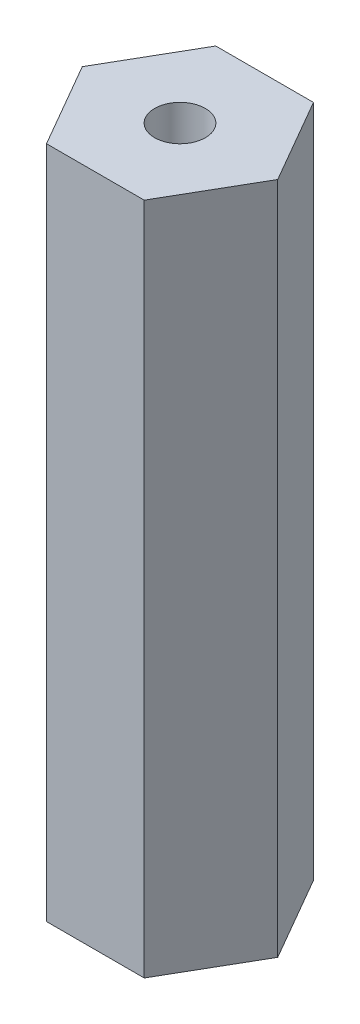
ISO-10303-21;
HEADER;
FILE_DESCRIPTION(('STEP AP214'),'2;1');
FILE_NAME('part.step','',(''),(''),'','','');
FILE_SCHEMA(('AUTOMOTIVE_DESIGN { 1 0 10303 214 1 1 1 1 }'));
ENDSEC;
DATA;
#1=APPLICATION_CONTEXT('core data for automotive mechanical design processes');
#2=APPLICATION_PROTOCOL_DEFINITION('international standard','automotive_design',2000,#1);
#3=PRODUCT_CONTEXT('',#1,'mechanical');
#4=PRODUCT('Part','Part','',(#3));
#5=PRODUCT_RELATED_PRODUCT_CATEGORY('part','',(#4));
#6=PRODUCT_DEFINITION_FORMATION('','',#4);
#7=PRODUCT_DEFINITION_CONTEXT('part definition',#1,'design');
#8=PRODUCT_DEFINITION('design','',#6,#7);
#9=PRODUCT_DEFINITION_SHAPE('','',#8);
#10=(LENGTH_UNIT() NAMED_UNIT(*) SI_UNIT(.MILLI.,.METRE.));
#11=(NAMED_UNIT(*) PLANE_ANGLE_UNIT() SI_UNIT($,.RADIAN.));
#12=(NAMED_UNIT(*) SI_UNIT($,.STERADIAN.) SOLID_ANGLE_UNIT());
#13=UNCERTAINTY_MEASURE_WITH_UNIT(LENGTH_MEASURE(1.E-05),#10,'distance_accuracy_value','');
#14=(GEOMETRIC_REPRESENTATION_CONTEXT(3) GLOBAL_UNCERTAINTY_ASSIGNED_CONTEXT((#13)) GLOBAL_UNIT_ASSIGNED_CONTEXT((#10,
#11,#12)) REPRESENTATION_CONTEXT('',''));
#15=CARTESIAN_POINT('',(0.,0.,0.));
#16=DIRECTION('',(0.,0.,1.));
#17=DIRECTION('',(1.,0.,0.));
#18=AXIS2_PLACEMENT_3D('',#15,#16,#17);
#19=CARTESIAN_POINT('',(79.7749924336777,38.3376261582597,-133.174340068554));
#20=DIRECTION('',(-0.866025403784442,0.,-0.499999999999995));
#21=DIRECTION('',(-0.499999999999995,0.,0.866025403784441));
#22=AXIS2_PLACEMENT_3D('',#19,#20,#21);
#23=PLANE('',#22);
#24=DIRECTION('',(0.499999999999995,0.,-0.866025403784441));
#25=VECTOR('',#24,1.);
#26=CARTESIAN_POINT('',(79.7749924336777,30.7,-133.174340068554));
#27=LINE('',#26,#25);
#28=CARTESIAN_POINT('',(1.44337567297412,30.7,2.49999999999997));
#29=VERTEX_POINT('',#28);
#30=CARTESIAN_POINT('',(2.88675134594811,30.7,0.));
#31=VERTEX_POINT('',#30);
#32=EDGE_CURVE('E115',#29,#31,#27,.T.);
#33=ORIENTED_EDGE('',*,*,#32,.F.);
#34=DIRECTION('',(0.,-1.,0.));
#35=VECTOR('',#34,1.);
#36=CARTESIAN_POINT('',(1.44337567297412,38.3376261582597,2.49999999999997));
#37=LINE('',#36,#35);
#38=CARTESIAN_POINT('',(1.44337567297412,10.8,2.49999999999997));
#39=VERTEX_POINT('',#38);
#40=EDGE_CURVE('E38',#29,#39,#37,.T.);
#41=ORIENTED_EDGE('',*,*,#40,.T.);
#42=DIRECTION('',(0.499999999999995,0.,-0.866025403784442));
#43=VECTOR('',#42,1.);
#44=CARTESIAN_POINT('',(79.7749924336777,10.8,-133.174340068554));
#45=LINE('',#44,#43);
#46=CARTESIAN_POINT('',(2.88675134594811,10.8,0.));
#47=VERTEX_POINT('',#46);
#48=EDGE_CURVE('E123',#39,#47,#45,.T.);
#49=ORIENTED_EDGE('',*,*,#48,.T.);
#50=DIRECTION('',(0.,-1.,0.));
#51=VECTOR('',#50,1.);
#52=CARTESIAN_POINT('',(2.88675134594811,38.3376261582597,0.));
#53=LINE('',#52,#51);
#54=EDGE_CURVE('E81',#31,#47,#53,.T.);
#55=ORIENTED_EDGE('',*,*,#54,.F.);
#56=EDGE_LOOP('',(#33,#41,#49,#55));
#57=FACE_BOUND('',#56,.T.);
#58=ADVANCED_FACE('F34',(#57),#23,.F.);
#59=CARTESIAN_POINT('',(16.5551341175392,38.3376261582597,23.6743334176948));
#60=DIRECTION('',(-0.866025403784438,0.,0.500000000000001));
#61=DIRECTION('',(0.500000000000001,0.,0.866025403784438));
#62=AXIS2_PLACEMENT_3D('',#59,#60,#61);
#63=PLANE('',#62);
#64=DIRECTION('',(-0.500000000000001,0.,-0.866025403784438));
#65=VECTOR('',#64,1.);
#66=CARTESIAN_POINT('',(16.5551341175392,30.7,23.6743334176948));
#67=LINE('',#66,#65);
#68=CARTESIAN_POINT('',(1.44337567297403,30.7,-2.49999999999998));
#69=VERTEX_POINT('',#68);
#70=EDGE_CURVE('E88',#31,#69,#67,.T.);
#71=ORIENTED_EDGE('',*,*,#70,.F.);
#72=ORIENTED_EDGE('',*,*,#54,.T.);
#73=DIRECTION('',(-0.500000000000001,0.,-0.866025403784438));
#74=VECTOR('',#73,1.);
#75=CARTESIAN_POINT('',(16.5551341175392,10.8,23.6743334176948));
#76=LINE('',#75,#74);
#77=CARTESIAN_POINT('',(1.44337567297403,10.8,-2.49999999999998));
#78=VERTEX_POINT('',#77);
#79=EDGE_CURVE('E122',#47,#78,#76,.T.);
#80=ORIENTED_EDGE('',*,*,#79,.T.);
#81=DIRECTION('',(0.,-1.,0.));
#82=VECTOR('',#81,1.);
#83=CARTESIAN_POINT('',(1.44337567297403,38.3376261582597,-2.49999999999998));
#84=LINE('',#83,#82);
#85=EDGE_CURVE('E124',#69,#78,#84,.T.);
#86=ORIENTED_EDGE('',*,*,#85,.F.);
#87=EDGE_LOOP('',(#71,#72,#80,#86));
#88=FACE_BOUND('',#87,.T.);
#89=ADVANCED_FACE('F161',(#88),#63,.F.);
#90=CARTESIAN_POINT('',(183.999999064592,38.3376261582597,-2.50000000000064));
#91=DIRECTION('',(0.,0.,1.));
#92=DIRECTION('',(1.,0.,0.));
#93=AXIS2_PLACEMENT_3D('',#90,#91,#92);
#94=PLANE('',#93);
#95=DIRECTION('',(-1.,0.,0.));
#96=VECTOR('',#95,1.);
#97=CARTESIAN_POINT('',(183.999999064592,30.7,-2.50000000000064));
#98=LINE('',#97,#96);
#99=CARTESIAN_POINT('',(-1.44337567297409,30.7,-2.49999999999995));
#100=VERTEX_POINT('',#99);
#101=EDGE_CURVE('E109',#69,#100,#98,.T.);
#102=ORIENTED_EDGE('',*,*,#101,.F.);
#103=ORIENTED_EDGE('',*,*,#85,.T.);
#104=DIRECTION('',(-1.,0.,0.));
#105=VECTOR('',#104,1.);
#106=CARTESIAN_POINT('',(183.999999064592,10.8,-2.50000000000064));
#107=LINE('',#106,#105);
#108=CARTESIAN_POINT('',(-1.44337567297409,10.8,-2.49999999999995));
#109=VERTEX_POINT('',#108);
#110=EDGE_CURVE('E126',#78,#109,#107,.T.);
#111=ORIENTED_EDGE('',*,*,#110,.T.);
#112=DIRECTION('',(0.,-1.,0.));
#113=VECTOR('',#112,1.);
#114=CARTESIAN_POINT('',(-1.44337567297409,38.3376261582597,-2.49999999999995));
#115=LINE('',#114,#113);
#116=EDGE_CURVE('E127',#100,#109,#115,.T.);
#117=ORIENTED_EDGE('',*,*,#116,.F.);
#118=EDGE_LOOP('',(#102,#103,#111,#117));
#119=FACE_BOUND('',#118,.T.);
#120=ADVANCED_FACE('F165',(#119),#94,.F.);
#121=CARTESIAN_POINT('',(75.4448654147555,38.3376261582597,-135.674340068554));
#122=DIRECTION('',(0.866025403784442,0.,0.499999999999995));
#123=DIRECTION('',(0.499999999999995,0.,-0.866025403784441));
#124=AXIS2_PLACEMENT_3D('',#121,#122,#123);
#125=PLANE('',#124);
#126=DIRECTION('',(-0.499999999999995,0.,0.866025403784441));
#127=VECTOR('',#126,1.);
#128=CARTESIAN_POINT('',(75.4448654147555,30.7,-135.674340068554));
#129=LINE('',#128,#127);
#130=CARTESIAN_POINT('',(-2.88675134594813,30.7,0.));
#131=VERTEX_POINT('',#130);
#132=EDGE_CURVE('E43',#100,#131,#129,.T.);
#133=ORIENTED_EDGE('',*,*,#132,.F.);
#134=ORIENTED_EDGE('',*,*,#116,.T.);
#135=DIRECTION('',(-0.499999999999995,0.,0.866025403784442));
#136=VECTOR('',#135,1.);
#137=CARTESIAN_POINT('',(75.4448654147555,10.8,-135.674340068554));
#138=LINE('',#137,#136);
#139=CARTESIAN_POINT('',(-2.88675134594813,10.8,0.));
#140=VERTEX_POINT('',#139);
#141=EDGE_CURVE('E104',#109,#140,#138,.T.);
#142=ORIENTED_EDGE('',*,*,#141,.T.);
#143=DIRECTION('',(0.,-1.,0.));
#144=VECTOR('',#143,1.);
#145=CARTESIAN_POINT('',(-2.88675134594813,38.3376261582597,0.));
#146=LINE('',#145,#144);
#147=EDGE_CURVE('E95',#131,#140,#146,.T.);
#148=ORIENTED_EDGE('',*,*,#147,.F.);
#149=EDGE_LOOP('',(#133,#134,#142,#148));
#150=FACE_BOUND('',#149,.T.);
#151=ADVANCED_FACE('F101',(#150),#125,.F.);
#152=CARTESIAN_POINT('',(12.2250070986179,38.3376261582597,26.1743334176959));
#153=DIRECTION('',(0.866025403784435,0.,-0.500000000000007));
#154=DIRECTION('',(-0.500000000000007,0.,-0.866025403784435));
#155=AXIS2_PLACEMENT_3D('',#152,#153,#154);
#156=PLANE('',#155);
#157=DIRECTION('',(0.500000000000007,0.,0.866025403784435));
#158=VECTOR('',#157,1.);
#159=CARTESIAN_POINT('',(12.2250070986179,30.7,26.1743334176959));
#160=LINE('',#159,#158);
#161=CARTESIAN_POINT('',(-1.44337567297406,30.7,2.5));
#162=VERTEX_POINT('',#161);
#163=EDGE_CURVE('E11',#131,#162,#160,.T.);
#164=ORIENTED_EDGE('',*,*,#163,.F.);
#165=ORIENTED_EDGE('',*,*,#147,.T.);
#166=DIRECTION('',(0.500000000000007,0.,0.866025403784434));
#167=VECTOR('',#166,1.);
#168=CARTESIAN_POINT('',(12.2250070986179,10.8,26.1743334176959));
#169=LINE('',#168,#167);
#170=CARTESIAN_POINT('',(-1.44337567297406,10.8,2.5));
#171=VERTEX_POINT('',#170);
#172=EDGE_CURVE('E106',#140,#171,#169,.T.);
#173=ORIENTED_EDGE('',*,*,#172,.T.);
#174=DIRECTION('',(0.,-1.,0.));
#175=VECTOR('',#174,1.);
#176=CARTESIAN_POINT('',(-1.44337567297406,38.3376261582597,2.5));
#177=LINE('',#176,#175);
#178=EDGE_CURVE('E56',#162,#171,#177,.T.);
#179=ORIENTED_EDGE('',*,*,#178,.F.);
#180=EDGE_LOOP('',(#164,#165,#173,#179));
#181=FACE_BOUND('',#180,.T.);
#182=ADVANCED_FACE('F94',(#181),#156,.F.);
#183=CARTESIAN_POINT('',(183.999999064592,38.3376261582597,2.49999999999805));
#184=DIRECTION('',(0.,0.,-1.));
#185=DIRECTION('',(-1.,0.,0.));
#186=AXIS2_PLACEMENT_3D('',#183,#184,#185);
#187=PLANE('',#186);
#188=DIRECTION('',(1.,0.,0.));
#189=VECTOR('',#188,1.);
#190=CARTESIAN_POINT('',(183.999999064592,30.7,2.49999999999805));
#191=LINE('',#190,#189);
#192=EDGE_CURVE('E118',#162,#29,#191,.T.);
#193=ORIENTED_EDGE('',*,*,#192,.F.);
#194=ORIENTED_EDGE('',*,*,#178,.T.);
#195=DIRECTION('',(1.,0.,0.));
#196=VECTOR('',#195,1.);
#197=CARTESIAN_POINT('',(183.999999064592,10.8,2.49999999999805));
#198=LINE('',#197,#196);
#199=EDGE_CURVE('E120',#171,#39,#198,.T.);
#200=ORIENTED_EDGE('',*,*,#199,.T.);
#201=ORIENTED_EDGE('',*,*,#40,.F.);
#202=EDGE_LOOP('',(#193,#194,#200,#201));
#203=FACE_BOUND('',#202,.T.);
#204=ADVANCED_FACE('F158',(#203),#187,.F.);
#205=CARTESIAN_POINT('',(0.,10.8,0.));
#206=DIRECTION('',(0.,1.,0.));
#207=DIRECTION('',(-1.,0.,0.));
#208=AXIS2_PLACEMENT_3D('',#205,#206,#207);
#209=PLANE('',#208);
#210=CARTESIAN_POINT('',(0.,10.8,0.));
#211=DIRECTION('',(0.,1.,0.));
#212=DIRECTION('',(0.,0.,1.));
#213=AXIS2_PLACEMENT_3D('',#210,#211,#212);
#214=CIRCLE('',#213,0.75);
#215=CARTESIAN_POINT('',(0.,10.8,0.749999999999996));
#216=VERTEX_POINT('',#215);
#217=EDGE_CURVE('E139',#216,#216,#214,.T.);
#218=ORIENTED_EDGE('',*,*,#217,.T.);
#219=EDGE_LOOP('',(#218));
#220=FACE_BOUND('',#219,.T.);
#221=ORIENTED_EDGE('',*,*,#48,.F.);
#222=ORIENTED_EDGE('',*,*,#199,.F.);
#223=ORIENTED_EDGE('',*,*,#172,.F.);
#224=ORIENTED_EDGE('',*,*,#141,.F.);
#225=ORIENTED_EDGE('',*,*,#110,.F.);
#226=ORIENTED_EDGE('',*,*,#79,.F.);
#227=EDGE_LOOP('',(#221,#222,#223,#224,#225,#226));
#228=FACE_BOUND('',#227,.T.);
#229=ADVANCED_FACE('F151',(#220,#228),#209,.F.);
#230=CARTESIAN_POINT('',(-3.06940204000003,30.7,-73.0680027231363));
#231=DIRECTION('',(0.,1.,0.));
#232=DIRECTION('',(1.,0.,0.));
#233=AXIS2_PLACEMENT_3D('',#230,#231,#232);
#234=PLANE('',#233);
#235=CARTESIAN_POINT('',(0.,30.7,0.));
#236=DIRECTION('',(0.,1.,0.));
#237=DIRECTION('',(0.,0.,1.));
#238=AXIS2_PLACEMENT_3D('',#235,#236,#237);
#239=CIRCLE('',#238,0.75);
#240=CARTESIAN_POINT('',(0.,30.7,0.749999999999996));
#241=VERTEX_POINT('',#240);
#242=EDGE_CURVE('E141',#241,#241,#239,.T.);
#243=ORIENTED_EDGE('',*,*,#242,.F.);
#244=EDGE_LOOP('',(#243));
#245=FACE_BOUND('',#244,.T.);
#246=ORIENTED_EDGE('',*,*,#192,.T.);
#247=ORIENTED_EDGE('',*,*,#32,.T.);
#248=ORIENTED_EDGE('',*,*,#70,.T.);
#249=ORIENTED_EDGE('',*,*,#101,.T.);
#250=ORIENTED_EDGE('',*,*,#132,.T.);
#251=ORIENTED_EDGE('',*,*,#163,.T.);
#252=EDGE_LOOP('',(#246,#247,#248,#249,#250,#251));
#253=FACE_BOUND('',#252,.T.);
#254=ADVANCED_FACE('F36',(#245,#253),#234,.T.);
#255=CARTESIAN_POINT('',(0.,10.8,0.));
#256=DIRECTION('',(0.,1.,0.));
#257=DIRECTION('',(0.,0.,1.));
#258=AXIS2_PLACEMENT_3D('',#255,#256,#257);
#259=CYLINDRICAL_SURFACE('',#258,0.75);
#260=ORIENTED_EDGE('',*,*,#217,.F.);
#261=EDGE_LOOP('',(#260));
#262=FACE_BOUND('',#261,.T.);
#263=ORIENTED_EDGE('',*,*,#242,.T.);
#264=EDGE_LOOP('',(#263));
#265=FACE_BOUND('',#264,.T.);
#266=ADVANCED_FACE('F148',(#262,#265),#259,.F.);
#267=CLOSED_SHELL('',(#58,#89,#120,#151,#182,#204,#229,#254,#266));
#268=MANIFOLD_SOLID_BREP('B2',#267);
#269=ADVANCED_BREP_SHAPE_REPRESENTATION('',(#18,#268),#14);
#270=SHAPE_DEFINITION_REPRESENTATION(#9,#269);
ENDSEC;
END-ISO-10303-21;
